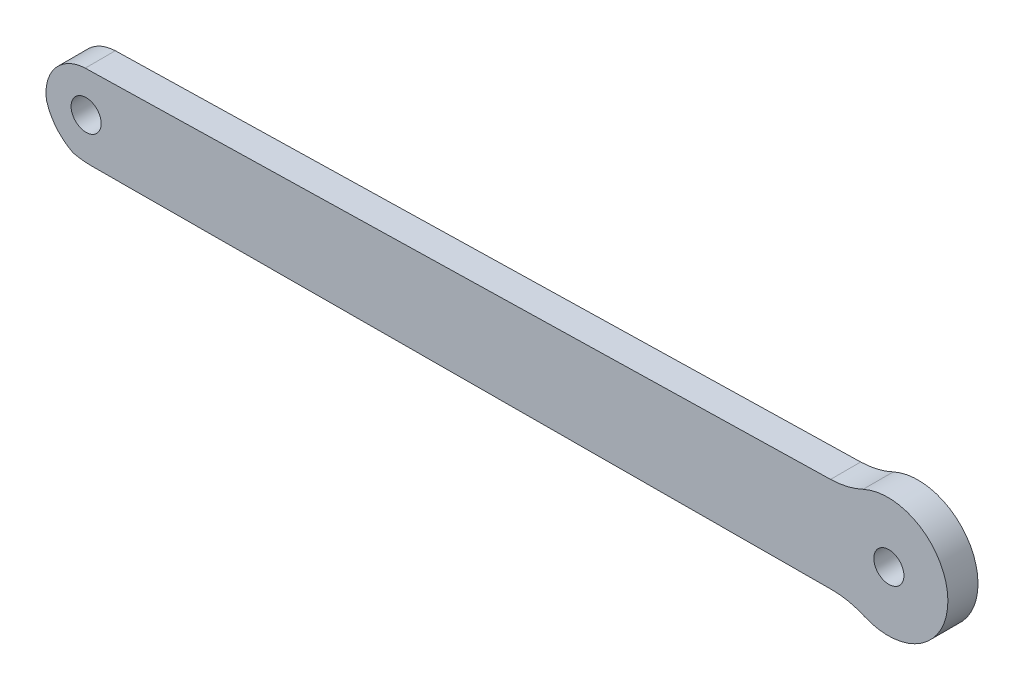
ISO-10303-21;
HEADER;
FILE_DESCRIPTION(('STEP AP214'),'2;1');
FILE_NAME('part.step','',(''),(''),'','','');
FILE_SCHEMA(('AUTOMOTIVE_DESIGN { 1 0 10303 214 1 1 1 1 }'));
ENDSEC;
DATA;
#1=APPLICATION_CONTEXT('core data for automotive mechanical design processes');
#2=APPLICATION_PROTOCOL_DEFINITION('international standard','automotive_design',2000,#1);
#3=PRODUCT_CONTEXT('',#1,'mechanical');
#4=PRODUCT('Part','Part','',(#3));
#5=PRODUCT_RELATED_PRODUCT_CATEGORY('part','',(#4));
#6=PRODUCT_DEFINITION_FORMATION('','',#4);
#7=PRODUCT_DEFINITION_CONTEXT('part definition',#1,'design');
#8=PRODUCT_DEFINITION('design','',#6,#7);
#9=PRODUCT_DEFINITION_SHAPE('','',#8);
#10=(LENGTH_UNIT() NAMED_UNIT(*) SI_UNIT(.MILLI.,.METRE.));
#11=(NAMED_UNIT(*) PLANE_ANGLE_UNIT() SI_UNIT($,.RADIAN.));
#12=(NAMED_UNIT(*) SI_UNIT($,.STERADIAN.) SOLID_ANGLE_UNIT());
#13=UNCERTAINTY_MEASURE_WITH_UNIT(LENGTH_MEASURE(1.E-05),#10,'distance_accuracy_value','');
#14=(GEOMETRIC_REPRESENTATION_CONTEXT(3) GLOBAL_UNCERTAINTY_ASSIGNED_CONTEXT((#13)) GLOBAL_UNIT_ASSIGNED_CONTEXT((#10,
#11,#12)) REPRESENTATION_CONTEXT('',''));
#15=CARTESIAN_POINT('',(0.,0.,0.));
#16=DIRECTION('',(0.,0.,1.));
#17=DIRECTION('',(1.,0.,0.));
#18=AXIS2_PLACEMENT_3D('',#15,#16,#17);
#19=CARTESIAN_POINT('',(111.226679622036,26.0885390894233,3.));
#20=DIRECTION('',(0.,0.,1.));
#21=DIRECTION('',(1.,0.,0.));
#22=AXIS2_PLACEMENT_3D('',#19,#20,#21);
#23=PLANE('',#22);
#24=CARTESIAN_POINT('',(31.3157120597114,25.1020877886528,3.));
#25=DIRECTION('',(0.,0.,1.));
#26=DIRECTION('',(1.,0.,0.));
#27=AXIS2_PLACEMENT_3D('',#24,#25,#26);
#28=CIRCLE('',#27,1.5);
#29=CARTESIAN_POINT('',(32.8157120597114,25.1020877886528,3.));
#30=VERTEX_POINT('',#29);
#31=EDGE_CURVE('E141',#30,#30,#28,.T.);
#32=ORIENTED_EDGE('',*,*,#31,.F.);
#33=EDGE_LOOP('',(#32));
#34=FACE_BOUND('',#33,.T.);
#35=CARTESIAN_POINT('',(111.226679622036,26.0885390894233,3.));
#36=DIRECTION('',(0.,0.,1.));
#37=DIRECTION('',(1.,0.,0.));
#38=AXIS2_PLACEMENT_3D('',#35,#36,#37);
#39=CIRCLE('',#38,5.96597153661804);
#40=CARTESIAN_POINT('',(108.879265089917,20.6037910195358,3.));
#41=VERTEX_POINT('',#40);
#42=CARTESIAN_POINT('',(108.744626540301,31.5136869100074,3.));
#43=VERTEX_POINT('',#42);
#44=EDGE_CURVE('E154',#41,#43,#39,.T.);
#45=ORIENTED_EDGE('',*,*,#44,.T.);
#46=CARTESIAN_POINT('',(105.324428188637,38.7461621789655,3.));
#47=DIRECTION('',(0.,0.,-1.));
#48=DIRECTION('',(1.,0.,0.));
#49=AXIS2_PLACEMENT_3D('',#46,#47,#48);
#50=CIRCLE('',#49,8.00040344487813);
#51=CARTESIAN_POINT('',(105.502006567109,30.7477297575271,3.));
#52=VERTEX_POINT('',#51);
#53=EDGE_CURVE('E97',#43,#52,#50,.T.);
#54=ORIENTED_EDGE('',*,*,#53,.T.);
#55=DIRECTION('',(-0.999754351339682,-0.0221638664806172,0.));
#56=VECTOR('',#55,1.);
#57=CARTESIAN_POINT('',(31.2270565921597,29.1011051923093,3.));
#58=LINE('',#57,#56);
#59=CARTESIAN_POINT('',(31.2270565921597,29.1011051923093,3.));
#60=VERTEX_POINT('',#59);
#61=EDGE_CURVE('E172',#52,#60,#58,.T.);
#62=ORIENTED_EDGE('',*,*,#61,.T.);
#63=CARTESIAN_POINT('',(31.3962578953953,25.0242813944039,3.));
#64=DIRECTION('',(0.,0.,1.));
#65=DIRECTION('',(1.,0.,0.));
#66=AXIS2_PLACEMENT_3D('',#63,#64,#65);
#67=CIRCLE('',#66,4.08033348639353);
#68=CARTESIAN_POINT('',(27.3628736849595,24.4070835564365,3.));
#69=VERTEX_POINT('',#68);
#70=EDGE_CURVE('E189',#60,#69,#67,.T.);
#71=ORIENTED_EDGE('',*,*,#70,.T.);
#72=CARTESIAN_POINT('',(32.3467311056324,25.8099552083081,3.));
#73=DIRECTION('',(0.,0.,1.));
#74=DIRECTION('',(1.,0.,0.));
#75=AXIS2_PLACEMENT_3D('',#72,#73,#74);
#76=CIRCLE('',#75,5.1775364471166);
#77=CARTESIAN_POINT('',(30.031202973056,21.1790575492718,3.));
#78=VERTEX_POINT('',#77);
#79=EDGE_CURVE('E188',#69,#78,#76,.T.);
#80=ORIENTED_EDGE('',*,*,#79,.T.);
#81=CARTESIAN_POINT('',(31.8398257520341,28.9725724939523,3.));
#82=DIRECTION('',(0.,0.,1.));
#83=DIRECTION('',(1.,0.,0.));
#84=AXIS2_PLACEMENT_3D('',#81,#82,#83);
#85=CIRCLE('',#84,8.00062444747891);
#86=CARTESIAN_POINT('',(31.8740758055696,20.9720213577224,3.));
#87=VERTEX_POINT('',#86);
#88=EDGE_CURVE('E119',#78,#87,#85,.T.);
#89=ORIENTED_EDGE('',*,*,#88,.T.);
#90=DIRECTION('',(0.999990723069275,0.00430740935922157,0.));
#91=VECTOR('',#90,1.);
#92=CARTESIAN_POINT('',(49.9684896727661,21.0499621284147,3.));
#93=LINE('',#92,#91);
#94=CARTESIAN_POINT('',(49.9684896727661,21.0499621284147,3.));
#95=VERTEX_POINT('',#94);
#96=EDGE_CURVE('E113',#87,#95,#93,.T.);
#97=ORIENTED_EDGE('',*,*,#96,.T.);
#98=DIRECTION('',(0.99999074479343,0.00430236301140771,0.));
#99=VECTOR('',#98,1.);
#100=CARTESIAN_POINT('',(49.9684896727661,21.0499621284147,3.));
#101=LINE('',#100,#99);
#102=CARTESIAN_POINT('',(105.618768597229,21.2893920460072,3.));
#103=VERTEX_POINT('',#102);
#104=EDGE_CURVE('E117',#95,#103,#101,.T.);
#105=ORIENTED_EDGE('',*,*,#104,.T.);
#106=CARTESIAN_POINT('',(105.639262652419,13.2911218183238,3.));
#107=DIRECTION('',(0.,0.,-1.));
#108=DIRECTION('',(1.,0.,0.));
#109=AXIS2_PLACEMENT_3D('',#106,#107,#108);
#110=CIRCLE('',#109,7.99829648371107);
#111=EDGE_CURVE('E51',#103,#41,#110,.T.);
#112=ORIENTED_EDGE('',*,*,#111,.T.);
#113=EDGE_LOOP('',(#45,#54,#62,#71,#80,#89,#97,#105,#112));
#114=FACE_BOUND('',#113,.T.);
#115=CARTESIAN_POINT('',(111.309575273182,26.0896036737292,3.));
#116=DIRECTION('',(0.,0.,1.));
#117=DIRECTION('',(1.,0.,0.));
#118=AXIS2_PLACEMENT_3D('',#115,#116,#117);
#119=CIRCLE('',#118,1.5);
#120=CARTESIAN_POINT('',(112.809575273182,26.0896036737292,3.));
#121=VERTEX_POINT('',#120);
#122=EDGE_CURVE('E199',#121,#121,#119,.T.);
#123=ORIENTED_EDGE('',*,*,#122,.F.);
#124=EDGE_LOOP('',(#123));
#125=FACE_BOUND('',#124,.T.);
#126=ADVANCED_FACE('F34',(#34,#114,#125),#23,.T.);
#127=CARTESIAN_POINT('',(111.226679622036,26.0885390894233,0.));
#128=DIRECTION('',(0.,0.,1.));
#129=DIRECTION('',(1.,0.,0.));
#130=AXIS2_PLACEMENT_3D('',#127,#128,#129);
#131=PLANE('',#130);
#132=CARTESIAN_POINT('',(111.226679622036,26.0885390894233,0.));
#133=DIRECTION('',(0.,0.,1.));
#134=DIRECTION('',(1.,0.,0.));
#135=AXIS2_PLACEMENT_3D('',#132,#133,#134);
#136=CIRCLE('',#135,5.96597153661804);
#137=CARTESIAN_POINT('',(108.879265089917,20.6037910195358,0.));
#138=VERTEX_POINT('',#137);
#139=CARTESIAN_POINT('',(108.744626540301,31.5136869100074,0.));
#140=VERTEX_POINT('',#139);
#141=EDGE_CURVE('E137',#138,#140,#136,.T.);
#142=ORIENTED_EDGE('',*,*,#141,.F.);
#143=CARTESIAN_POINT('',(105.639262652419,13.2911218183238,0.));
#144=DIRECTION('',(0.,0.,-1.));
#145=DIRECTION('',(1.,0.,0.));
#146=AXIS2_PLACEMENT_3D('',#143,#144,#145);
#147=CIRCLE('',#146,7.99829648371107);
#148=CARTESIAN_POINT('',(105.618768597229,21.2893920460072,0.));
#149=VERTEX_POINT('',#148);
#150=EDGE_CURVE('E89',#149,#138,#147,.T.);
#151=ORIENTED_EDGE('',*,*,#150,.F.);
#152=DIRECTION('',(0.99999074479343,0.00430236301140771,0.));
#153=VECTOR('',#152,1.);
#154=CARTESIAN_POINT('',(49.9684896727661,21.0499621284147,0.));
#155=LINE('',#154,#153);
#156=CARTESIAN_POINT('',(49.9684896727661,21.0499621284147,0.));
#157=VERTEX_POINT('',#156);
#158=EDGE_CURVE('E83',#157,#149,#155,.T.);
#159=ORIENTED_EDGE('',*,*,#158,.F.);
#160=DIRECTION('',(0.999990723069275,0.00430740935922157,0.));
#161=VECTOR('',#160,1.);
#162=CARTESIAN_POINT('',(49.9684896727661,21.0499621284147,0.));
#163=LINE('',#162,#161);
#164=CARTESIAN_POINT('',(31.8740758055696,20.9720213577224,0.));
#165=VERTEX_POINT('',#164);
#166=EDGE_CURVE('E127',#165,#157,#163,.T.);
#167=ORIENTED_EDGE('',*,*,#166,.F.);
#168=CARTESIAN_POINT('',(31.8398257520341,28.9725724939523,0.));
#169=DIRECTION('',(0.,0.,1.));
#170=DIRECTION('',(1.,0.,0.));
#171=AXIS2_PLACEMENT_3D('',#168,#169,#170);
#172=CIRCLE('',#171,8.00062444747891);
#173=CARTESIAN_POINT('',(30.031202973056,21.1790575492718,0.));
#174=VERTEX_POINT('',#173);
#175=EDGE_CURVE('E149',#174,#165,#172,.T.);
#176=ORIENTED_EDGE('',*,*,#175,.F.);
#177=CARTESIAN_POINT('',(32.3467311056324,25.8099552083081,0.));
#178=DIRECTION('',(0.,0.,1.));
#179=DIRECTION('',(1.,0.,0.));
#180=AXIS2_PLACEMENT_3D('',#177,#178,#179);
#181=CIRCLE('',#180,5.1775364471166);
#182=CARTESIAN_POINT('',(27.3628736849595,24.4070835564365,0.));
#183=VERTEX_POINT('',#182);
#184=EDGE_CURVE('E147',#183,#174,#181,.T.);
#185=ORIENTED_EDGE('',*,*,#184,.F.);
#186=CARTESIAN_POINT('',(31.3962578953953,25.0242813944039,0.));
#187=DIRECTION('',(0.,0.,1.));
#188=DIRECTION('',(1.,0.,0.));
#189=AXIS2_PLACEMENT_3D('',#186,#187,#188);
#190=CIRCLE('',#189,4.08033348639353);
#191=CARTESIAN_POINT('',(31.2270565921597,29.1011051923093,0.));
#192=VERTEX_POINT('',#191);
#193=EDGE_CURVE('E145',#192,#183,#190,.T.);
#194=ORIENTED_EDGE('',*,*,#193,.F.);
#195=DIRECTION('',(-0.999754351339682,-0.0221638664806172,0.));
#196=VECTOR('',#195,1.);
#197=CARTESIAN_POINT('',(31.2270565921597,29.1011051923093,0.));
#198=LINE('',#197,#196);
#199=CARTESIAN_POINT('',(105.502006567109,30.7477297575271,0.));
#200=VERTEX_POINT('',#199);
#201=EDGE_CURVE('E143',#200,#192,#198,.T.);
#202=ORIENTED_EDGE('',*,*,#201,.F.);
#203=CARTESIAN_POINT('',(105.324428188637,38.7461621789655,0.));
#204=DIRECTION('',(0.,0.,-1.));
#205=DIRECTION('',(1.,0.,0.));
#206=AXIS2_PLACEMENT_3D('',#203,#204,#205);
#207=CIRCLE('',#206,8.00040344487813);
#208=EDGE_CURVE('E140',#140,#200,#207,.T.);
#209=ORIENTED_EDGE('',*,*,#208,.F.);
#210=EDGE_LOOP('',(#142,#151,#159,#167,#176,#185,#194,#202,#209));
#211=FACE_BOUND('',#210,.T.);
#212=CARTESIAN_POINT('',(31.3157120597114,25.1020877886528,0.));
#213=DIRECTION('',(0.,0.,1.));
#214=DIRECTION('',(1.,0.,0.));
#215=AXIS2_PLACEMENT_3D('',#212,#213,#214);
#216=CIRCLE('',#215,1.5);
#217=CARTESIAN_POINT('',(32.8157120597114,25.1020877886528,0.));
#218=VERTEX_POINT('',#217);
#219=EDGE_CURVE('E196',#218,#218,#216,.T.);
#220=ORIENTED_EDGE('',*,*,#219,.T.);
#221=EDGE_LOOP('',(#220));
#222=FACE_BOUND('',#221,.T.);
#223=CARTESIAN_POINT('',(111.309575273182,26.0896036737292,0.));
#224=DIRECTION('',(0.,0.,1.));
#225=DIRECTION('',(1.,0.,0.));
#226=AXIS2_PLACEMENT_3D('',#223,#224,#225);
#227=CIRCLE('',#226,1.5);
#228=CARTESIAN_POINT('',(112.809575273182,26.0896036737292,0.));
#229=VERTEX_POINT('',#228);
#230=EDGE_CURVE('E202',#229,#229,#227,.T.);
#231=ORIENTED_EDGE('',*,*,#230,.T.);
#232=EDGE_LOOP('',(#231));
#233=FACE_BOUND('',#232,.T.);
#234=ADVANCED_FACE('F176',(#211,#222,#233),#131,.F.);
#235=CARTESIAN_POINT('',(111.226679622036,26.0885390894233,3.));
#236=DIRECTION('',(0.,0.,-1.));
#237=DIRECTION('',(-1.,0.,0.));
#238=AXIS2_PLACEMENT_3D('',#235,#236,#237);
#239=CYLINDRICAL_SURFACE('',#238,5.96597153661804);
#240=ORIENTED_EDGE('',*,*,#141,.T.);
#241=DIRECTION('',(0.,0.,-1.));
#242=VECTOR('',#241,1.);
#243=CARTESIAN_POINT('',(108.744626540301,31.5136869100074,3.));
#244=LINE('',#243,#242);
#245=EDGE_CURVE('E11',#43,#140,#244,.T.);
#246=ORIENTED_EDGE('',*,*,#245,.F.);
#247=ORIENTED_EDGE('',*,*,#44,.F.);
#248=DIRECTION('',(0.,0.,-1.));
#249=VECTOR('',#248,1.);
#250=CARTESIAN_POINT('',(108.879265089917,20.6037910195358,3.));
#251=LINE('',#250,#249);
#252=EDGE_CURVE('E133',#41,#138,#251,.T.);
#253=ORIENTED_EDGE('',*,*,#252,.T.);
#254=EDGE_LOOP('',(#240,#246,#247,#253));
#255=FACE_BOUND('',#254,.T.);
#256=ADVANCED_FACE('F36',(#255),#239,.T.);
#257=CARTESIAN_POINT('',(105.324428188637,38.7461621789655,3.));
#258=DIRECTION('',(0.,0.,-1.));
#259=DIRECTION('',(-1.,0.,0.));
#260=AXIS2_PLACEMENT_3D('',#257,#258,#259);
#261=CYLINDRICAL_SURFACE('',#260,8.00040344487813);
#262=ORIENTED_EDGE('',*,*,#208,.T.);
#263=DIRECTION('',(0.,0.,-1.));
#264=VECTOR('',#263,1.);
#265=CARTESIAN_POINT('',(105.502006567109,30.7477297575271,3.));
#266=LINE('',#265,#264);
#267=EDGE_CURVE('E43',#52,#200,#266,.T.);
#268=ORIENTED_EDGE('',*,*,#267,.F.);
#269=ORIENTED_EDGE('',*,*,#53,.F.);
#270=ORIENTED_EDGE('',*,*,#245,.T.);
#271=EDGE_LOOP('',(#262,#268,#269,#270));
#272=FACE_BOUND('',#271,.T.);
#273=ADVANCED_FACE('F238',(#272),#261,.F.);
#274=CARTESIAN_POINT('',(31.2270565921597,29.1011051923093,3.));
#275=DIRECTION('',(0.0221638664806172,-0.999754351339683,0.));
#276=DIRECTION('',(0.999754351339683,0.0221638664806172,0.));
#277=AXIS2_PLACEMENT_3D('',#274,#275,#276);
#278=PLANE('',#277);
#279=ORIENTED_EDGE('',*,*,#201,.T.);
#280=DIRECTION('',(0.,0.,-1.));
#281=VECTOR('',#280,1.);
#282=CARTESIAN_POINT('',(31.2270565921597,29.1011051923093,3.));
#283=LINE('',#282,#281);
#284=EDGE_CURVE('E164',#60,#192,#283,.T.);
#285=ORIENTED_EDGE('',*,*,#284,.F.);
#286=ORIENTED_EDGE('',*,*,#61,.F.);
#287=ORIENTED_EDGE('',*,*,#267,.T.);
#288=EDGE_LOOP('',(#279,#285,#286,#287));
#289=FACE_BOUND('',#288,.T.);
#290=ADVANCED_FACE('F170',(#289),#278,.F.);
#291=CARTESIAN_POINT('',(31.3962578953953,25.0242813944039,3.));
#292=DIRECTION('',(0.,0.,-1.));
#293=DIRECTION('',(-1.,0.,0.));
#294=AXIS2_PLACEMENT_3D('',#291,#292,#293);
#295=CYLINDRICAL_SURFACE('',#294,4.08033348639353);
#296=ORIENTED_EDGE('',*,*,#193,.T.);
#297=DIRECTION('',(0.,0.,-1.));
#298=VECTOR('',#297,1.);
#299=CARTESIAN_POINT('',(27.3628736849595,24.4070835564365,3.));
#300=LINE('',#299,#298);
#301=EDGE_CURVE('E161',#69,#183,#300,.T.);
#302=ORIENTED_EDGE('',*,*,#301,.F.);
#303=ORIENTED_EDGE('',*,*,#70,.F.);
#304=ORIENTED_EDGE('',*,*,#284,.T.);
#305=EDGE_LOOP('',(#296,#302,#303,#304));
#306=FACE_BOUND('',#305,.T.);
#307=ADVANCED_FACE('F182',(#306),#295,.T.);
#308=CARTESIAN_POINT('',(32.3467311056324,25.8099552083081,3.));
#309=DIRECTION('',(0.,0.,-1.));
#310=DIRECTION('',(-1.,0.,0.));
#311=AXIS2_PLACEMENT_3D('',#308,#309,#310);
#312=CYLINDRICAL_SURFACE('',#311,5.1775364471166);
#313=ORIENTED_EDGE('',*,*,#184,.T.);
#314=DIRECTION('',(0.,0.,-1.));
#315=VECTOR('',#314,1.);
#316=CARTESIAN_POINT('',(30.031202973056,21.1790575492718,3.));
#317=LINE('',#316,#315);
#318=EDGE_CURVE('E158',#78,#174,#317,.T.);
#319=ORIENTED_EDGE('',*,*,#318,.F.);
#320=ORIENTED_EDGE('',*,*,#79,.F.);
#321=ORIENTED_EDGE('',*,*,#301,.T.);
#322=EDGE_LOOP('',(#313,#319,#320,#321));
#323=FACE_BOUND('',#322,.T.);
#324=ADVANCED_FACE('F186',(#323),#312,.T.);
#325=CARTESIAN_POINT('',(31.8398257520341,28.9725724939523,3.));
#326=DIRECTION('',(0.,0.,-1.));
#327=DIRECTION('',(-1.,0.,0.));
#328=AXIS2_PLACEMENT_3D('',#325,#326,#327);
#329=CYLINDRICAL_SURFACE('',#328,8.00062444747891);
#330=ORIENTED_EDGE('',*,*,#175,.T.);
#331=DIRECTION('',(0.,0.,-1.));
#332=VECTOR('',#331,1.);
#333=CARTESIAN_POINT('',(31.8740758055696,20.9720213577224,3.));
#334=LINE('',#333,#332);
#335=EDGE_CURVE('E128',#87,#165,#334,.T.);
#336=ORIENTED_EDGE('',*,*,#335,.F.);
#337=ORIENTED_EDGE('',*,*,#88,.F.);
#338=ORIENTED_EDGE('',*,*,#318,.T.);
#339=EDGE_LOOP('',(#330,#336,#337,#338));
#340=FACE_BOUND('',#339,.T.);
#341=ADVANCED_FACE('F229',(#340),#329,.T.);
#342=CARTESIAN_POINT('',(49.9684896727661,21.0499621284147,3.));
#343=DIRECTION('',(-0.00430740935922157,0.999990723069275,0.));
#344=DIRECTION('',(-0.999990723069275,-0.00430740935922157,0.));
#345=AXIS2_PLACEMENT_3D('',#342,#343,#344);
#346=PLANE('',#345);
#347=ORIENTED_EDGE('',*,*,#166,.T.);
#348=DIRECTION('',(0.,0.,-1.));
#349=VECTOR('',#348,1.);
#350=CARTESIAN_POINT('',(49.9684896727661,21.0499621284147,3.));
#351=LINE('',#350,#349);
#352=EDGE_CURVE('E124',#95,#157,#351,.T.);
#353=ORIENTED_EDGE('',*,*,#352,.F.);
#354=ORIENTED_EDGE('',*,*,#96,.F.);
#355=ORIENTED_EDGE('',*,*,#335,.T.);
#356=EDGE_LOOP('',(#347,#353,#354,#355));
#357=FACE_BOUND('',#356,.T.);
#358=ADVANCED_FACE('F125',(#357),#346,.F.);
#359=CARTESIAN_POINT('',(49.9684896727661,21.0499621284147,3.));
#360=DIRECTION('',(-0.00430236301140771,0.999990744793429,0.));
#361=DIRECTION('',(-0.99999074479343,-0.00430236301140771,0.));
#362=AXIS2_PLACEMENT_3D('',#359,#360,#361);
#363=PLANE('',#362);
#364=ORIENTED_EDGE('',*,*,#158,.T.);
#365=DIRECTION('',(0.,0.,-1.));
#366=VECTOR('',#365,1.);
#367=CARTESIAN_POINT('',(105.618768597229,21.2893920460072,3.));
#368=LINE('',#367,#366);
#369=EDGE_CURVE('E129',#103,#149,#368,.T.);
#370=ORIENTED_EDGE('',*,*,#369,.F.);
#371=ORIENTED_EDGE('',*,*,#104,.F.);
#372=ORIENTED_EDGE('',*,*,#352,.T.);
#373=EDGE_LOOP('',(#364,#370,#371,#372));
#374=FACE_BOUND('',#373,.T.);
#375=ADVANCED_FACE('F131',(#374),#363,.F.);
#376=CARTESIAN_POINT('',(105.639262652419,13.2911218183238,3.));
#377=DIRECTION('',(0.,0.,-1.));
#378=DIRECTION('',(-1.,0.,0.));
#379=AXIS2_PLACEMENT_3D('',#376,#377,#378);
#380=CYLINDRICAL_SURFACE('',#379,7.99829648371107);
#381=ORIENTED_EDGE('',*,*,#150,.T.);
#382=ORIENTED_EDGE('',*,*,#252,.F.);
#383=ORIENTED_EDGE('',*,*,#111,.F.);
#384=ORIENTED_EDGE('',*,*,#369,.T.);
#385=EDGE_LOOP('',(#381,#382,#383,#384));
#386=FACE_BOUND('',#385,.T.);
#387=ADVANCED_FACE('F222',(#386),#380,.F.);
#388=CARTESIAN_POINT('',(31.3157120597114,25.1020877886528,3.));
#389=DIRECTION('',(0.,0.,-1.));
#390=DIRECTION('',(-1.,0.,0.));
#391=AXIS2_PLACEMENT_3D('',#388,#389,#390);
#392=CYLINDRICAL_SURFACE('',#391,1.5);
#393=ORIENTED_EDGE('',*,*,#31,.T.);
#394=EDGE_LOOP('',(#393));
#395=FACE_BOUND('',#394,.T.);
#396=ORIENTED_EDGE('',*,*,#219,.F.);
#397=EDGE_LOOP('',(#396));
#398=FACE_BOUND('',#397,.T.);
#399=ADVANCED_FACE('F219',(#395,#398),#392,.F.);
#400=CARTESIAN_POINT('',(111.309575273182,26.0896036737292,3.));
#401=DIRECTION('',(0.,0.,-1.));
#402=DIRECTION('',(-1.,0.,0.));
#403=AXIS2_PLACEMENT_3D('',#400,#401,#402);
#404=CYLINDRICAL_SURFACE('',#403,1.5);
#405=ORIENTED_EDGE('',*,*,#122,.T.);
#406=EDGE_LOOP('',(#405));
#407=FACE_BOUND('',#406,.T.);
#408=ORIENTED_EDGE('',*,*,#230,.F.);
#409=EDGE_LOOP('',(#408));
#410=FACE_BOUND('',#409,.T.);
#411=ADVANCED_FACE('F208',(#407,#410),#404,.F.);
#412=CLOSED_SHELL('',(#126,#234,#256,#273,#290,#307,#324,#341,#358,#375,#387,#399,#411));
#413=MANIFOLD_SOLID_BREP('B2',#412);
#414=ADVANCED_BREP_SHAPE_REPRESENTATION('',(#18,#413),#14);
#415=SHAPE_DEFINITION_REPRESENTATION(#9,#414);
ENDSEC;
END-ISO-10303-21;
